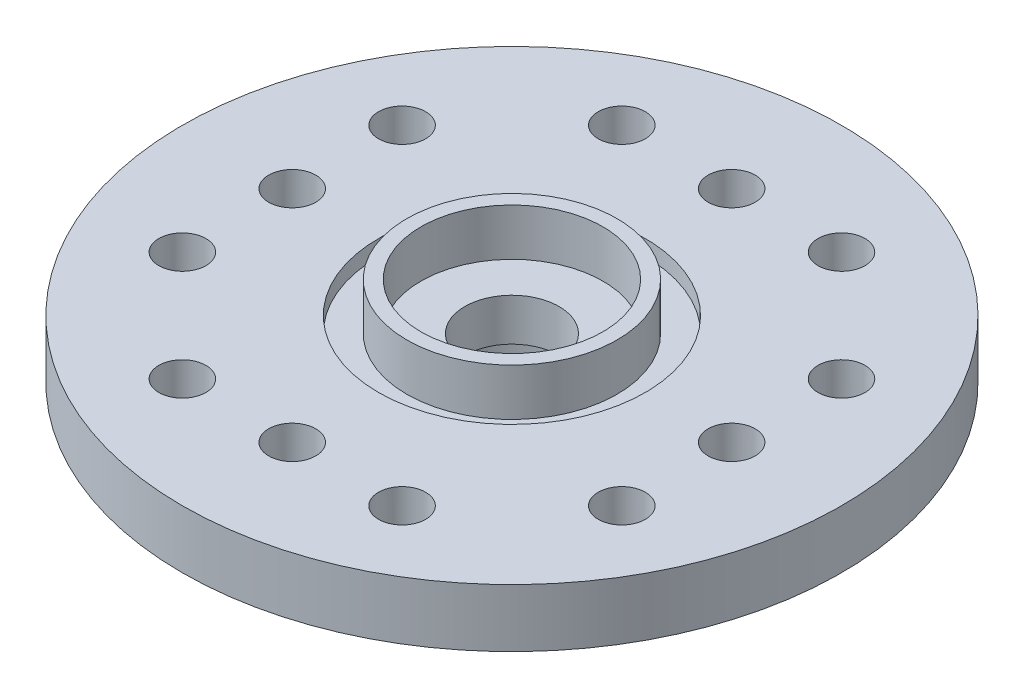
ISO-10303-21;
HEADER;
FILE_DESCRIPTION(('STEP AP214'),'2;1');
FILE_NAME('part.step','',(''),(''),'','','');
FILE_SCHEMA(('AUTOMOTIVE_DESIGN { 1 0 10303 214 1 1 1 1 }'));
ENDSEC;
DATA;
#1=APPLICATION_CONTEXT('core data for automotive mechanical design processes');
#2=APPLICATION_PROTOCOL_DEFINITION('international standard','automotive_design',2000,#1);
#3=PRODUCT_CONTEXT('',#1,'mechanical');
#4=PRODUCT('Part','Part','',(#3));
#5=PRODUCT_RELATED_PRODUCT_CATEGORY('part','',(#4));
#6=PRODUCT_DEFINITION_FORMATION('','',#4);
#7=PRODUCT_DEFINITION_CONTEXT('part definition',#1,'design');
#8=PRODUCT_DEFINITION('design','',#6,#7);
#9=PRODUCT_DEFINITION_SHAPE('','',#8);
#10=(LENGTH_UNIT() NAMED_UNIT(*) SI_UNIT(.MILLI.,.METRE.));
#11=(NAMED_UNIT(*) PLANE_ANGLE_UNIT() SI_UNIT($,.RADIAN.));
#12=(NAMED_UNIT(*) SI_UNIT($,.STERADIAN.) SOLID_ANGLE_UNIT());
#13=UNCERTAINTY_MEASURE_WITH_UNIT(LENGTH_MEASURE(1.E-05),#10,'distance_accuracy_value','');
#14=(GEOMETRIC_REPRESENTATION_CONTEXT(3) GLOBAL_UNCERTAINTY_ASSIGNED_CONTEXT((#13)) GLOBAL_UNIT_ASSIGNED_CONTEXT((#10,
#11,#12)) REPRESENTATION_CONTEXT('',''));
#15=CARTESIAN_POINT('',(0.,0.,0.));
#16=DIRECTION('',(0.,0.,1.));
#17=DIRECTION('',(1.,0.,0.));
#18=AXIS2_PLACEMENT_3D('',#15,#16,#17);
#19=CARTESIAN_POINT('',(0.,0.,0.));
#20=DIRECTION('',(0.,1.,0.));
#21=DIRECTION('',(0.,0.,1.));
#22=AXIS2_PLACEMENT_3D('',#19,#20,#21);
#23=PLANE('',#22);
#24=CARTESIAN_POINT('',(-6.99999999999996,0.,-3.50000000000007));
#25=DIRECTION('',(0.,1.,0.));
#26=DIRECTION('',(0.,0.,1.));
#27=AXIS2_PLACEMENT_3D('',#24,#25,#26);
#28=CIRCLE('',#27,0.75);
#29=CARTESIAN_POINT('',(-6.99999999999996,0.,-2.75000000000007));
#30=VERTEX_POINT('',#29);
#31=EDGE_CURVE('E144',#30,#30,#28,.T.);
#32=ORIENTED_EDGE('',*,*,#31,.T.);
#33=EDGE_LOOP('',(#32));
#34=FACE_BOUND('',#33,.T.);
#35=CARTESIAN_POINT('',(-7.,0.,0.));
#36=DIRECTION('',(0.,1.,0.));
#37=DIRECTION('',(0.,0.,1.));
#38=AXIS2_PLACEMENT_3D('',#35,#36,#37);
#39=CIRCLE('',#38,0.75);
#40=CARTESIAN_POINT('',(-7.,0.,0.749999999999927));
#41=VERTEX_POINT('',#40);
#42=EDGE_CURVE('E138',#41,#41,#39,.T.);
#43=ORIENTED_EDGE('',*,*,#42,.T.);
#44=EDGE_LOOP('',(#43));
#45=FACE_BOUND('',#44,.T.);
#46=CARTESIAN_POINT('',(-7.00000000000004,0.,3.49999999999993));
#47=DIRECTION('',(0.,1.,0.));
#48=DIRECTION('',(0.,0.,1.));
#49=AXIS2_PLACEMENT_3D('',#46,#47,#48);
#50=CIRCLE('',#49,0.75);
#51=CARTESIAN_POINT('',(-7.00000000000004,0.,4.24999999999993));
#52=VERTEX_POINT('',#51);
#53=EDGE_CURVE('E132',#52,#52,#50,.T.);
#54=ORIENTED_EDGE('',*,*,#53,.T.);
#55=EDGE_LOOP('',(#54));
#56=FACE_BOUND('',#55,.T.);
#57=CARTESIAN_POINT('',(-3.5,0.,7.));
#58=DIRECTION('',(0.,1.,0.));
#59=DIRECTION('',(0.,0.,1.));
#60=AXIS2_PLACEMENT_3D('',#57,#58,#59);
#61=CIRCLE('',#60,0.75);
#62=CARTESIAN_POINT('',(-3.5,0.,7.75));
#63=VERTEX_POINT('',#62);
#64=EDGE_CURVE('E126',#63,#63,#61,.T.);
#65=ORIENTED_EDGE('',*,*,#64,.T.);
#66=EDGE_LOOP('',(#65));
#67=FACE_BOUND('',#66,.T.);
#68=CARTESIAN_POINT('',(0.,0.,7.));
#69=DIRECTION('',(0.,1.,0.));
#70=DIRECTION('',(0.,0.,1.));
#71=AXIS2_PLACEMENT_3D('',#68,#69,#70);
#72=CIRCLE('',#71,0.75);
#73=CARTESIAN_POINT('',(0.,0.,7.75));
#74=VERTEX_POINT('',#73);
#75=EDGE_CURVE('E120',#74,#74,#72,.T.);
#76=ORIENTED_EDGE('',*,*,#75,.T.);
#77=EDGE_LOOP('',(#76));
#78=FACE_BOUND('',#77,.T.);
#79=CARTESIAN_POINT('',(3.5,0.,7.));
#80=DIRECTION('',(0.,1.,0.));
#81=DIRECTION('',(0.,0.,1.));
#82=AXIS2_PLACEMENT_3D('',#79,#80,#81);
#83=CIRCLE('',#82,0.75);
#84=CARTESIAN_POINT('',(3.5,0.,7.75));
#85=VERTEX_POINT('',#84);
#86=EDGE_CURVE('E114',#85,#85,#83,.T.);
#87=ORIENTED_EDGE('',*,*,#86,.T.);
#88=EDGE_LOOP('',(#87));
#89=FACE_BOUND('',#88,.T.);
#90=CARTESIAN_POINT('',(6.99999999999999,0.,3.50000000000002));
#91=DIRECTION('',(0.,1.,0.));
#92=DIRECTION('',(0.,0.,1.));
#93=AXIS2_PLACEMENT_3D('',#90,#91,#92);
#94=CIRCLE('',#93,0.75);
#95=CARTESIAN_POINT('',(6.99999999999999,0.,4.25000000000002));
#96=VERTEX_POINT('',#95);
#97=EDGE_CURVE('E108',#96,#96,#94,.T.);
#98=ORIENTED_EDGE('',*,*,#97,.T.);
#99=EDGE_LOOP('',(#98));
#100=FACE_BOUND('',#99,.T.);
#101=CARTESIAN_POINT('',(7.,0.,0.));
#102=DIRECTION('',(0.,1.,0.));
#103=DIRECTION('',(0.,0.,1.));
#104=AXIS2_PLACEMENT_3D('',#101,#102,#103);
#105=CIRCLE('',#104,0.75);
#106=CARTESIAN_POINT('',(7.,0.,0.750000000000025));
#107=VERTEX_POINT('',#106);
#108=EDGE_CURVE('E102',#107,#107,#105,.T.);
#109=ORIENTED_EDGE('',*,*,#108,.T.);
#110=EDGE_LOOP('',(#109));
#111=FACE_BOUND('',#110,.T.);
#112=CARTESIAN_POINT('',(7.00000000000001,0.,-3.49999999999998));
#113=DIRECTION('',(0.,1.,0.));
#114=DIRECTION('',(0.,0.,1.));
#115=AXIS2_PLACEMENT_3D('',#112,#113,#114);
#116=CIRCLE('',#115,0.75);
#117=CARTESIAN_POINT('',(7.00000000000001,0.,-2.74999999999998));
#118=VERTEX_POINT('',#117);
#119=EDGE_CURVE('E96',#118,#118,#116,.T.);
#120=ORIENTED_EDGE('',*,*,#119,.T.);
#121=EDGE_LOOP('',(#120));
#122=FACE_BOUND('',#121,.T.);
#123=CARTESIAN_POINT('',(3.5,0.,-7.));
#124=DIRECTION('',(0.,1.,0.));
#125=DIRECTION('',(0.,0.,1.));
#126=AXIS2_PLACEMENT_3D('',#123,#124,#125);
#127=CIRCLE('',#126,0.75);
#128=CARTESIAN_POINT('',(3.5,0.,-6.25));
#129=VERTEX_POINT('',#128);
#130=EDGE_CURVE('E90',#129,#129,#127,.T.);
#131=ORIENTED_EDGE('',*,*,#130,.T.);
#132=EDGE_LOOP('',(#131));
#133=FACE_BOUND('',#132,.T.);
#134=CARTESIAN_POINT('',(0.,0.,-7.));
#135=DIRECTION('',(0.,1.,0.));
#136=DIRECTION('',(0.,0.,1.));
#137=AXIS2_PLACEMENT_3D('',#134,#135,#136);
#138=CIRCLE('',#137,0.75);
#139=CARTESIAN_POINT('',(0.,0.,-6.25));
#140=VERTEX_POINT('',#139);
#141=EDGE_CURVE('E84',#140,#140,#138,.T.);
#142=ORIENTED_EDGE('',*,*,#141,.T.);
#143=EDGE_LOOP('',(#142));
#144=FACE_BOUND('',#143,.T.);
#145=CARTESIAN_POINT('',(-3.5,0.,-7.));
#146=DIRECTION('',(0.,1.,0.));
#147=DIRECTION('',(0.,0.,1.));
#148=AXIS2_PLACEMENT_3D('',#145,#146,#147);
#149=CIRCLE('',#148,0.75);
#150=CARTESIAN_POINT('',(-3.5,0.,-6.25));
#151=VERTEX_POINT('',#150);
#152=EDGE_CURVE('E78',#151,#151,#149,.T.);
#153=ORIENTED_EDGE('',*,*,#152,.T.);
#154=EDGE_LOOP('',(#153));
#155=FACE_BOUND('',#154,.T.);
#156=CARTESIAN_POINT('',(0.,0.,0.));
#157=DIRECTION('',(0.,1.,0.));
#158=DIRECTION('',(0.,0.,1.));
#159=AXIS2_PLACEMENT_3D('',#156,#157,#158);
#160=CIRCLE('',#159,10.5);
#161=CARTESIAN_POINT('',(0.,0.,10.5));
#162=VERTEX_POINT('',#161);
#163=EDGE_CURVE('E46',#162,#162,#160,.T.);
#164=ORIENTED_EDGE('',*,*,#163,.F.);
#165=EDGE_LOOP('',(#164));
#166=FACE_BOUND('',#165,.T.);
#167=CARTESIAN_POINT('',(0.,0.,0.));
#168=DIRECTION('',(0.,1.,0.));
#169=DIRECTION('',(0.,0.,1.));
#170=AXIS2_PLACEMENT_3D('',#167,#168,#169);
#171=CIRCLE('',#170,4.5);
#172=CARTESIAN_POINT('',(0.,0.,4.5));
#173=VERTEX_POINT('',#172);
#174=EDGE_CURVE('E10',#173,#173,#171,.F.);
#175=ORIENTED_EDGE('',*,*,#174,.F.);
#176=EDGE_LOOP('',(#175));
#177=FACE_BOUND('',#176,.T.);
#178=ADVANCED_FACE('F31',(#34,#45,#56,#67,#78,#89,#100,#111,#122,#133,#144,#155,#166,#177),#23,.F.);
#179=CARTESIAN_POINT('',(0.,1.35,0.));
#180=DIRECTION('',(0.,1.,0.));
#181=DIRECTION('',(0.,0.,1.));
#182=AXIS2_PLACEMENT_3D('',#179,#180,#181);
#183=PLANE('',#182);
#184=CARTESIAN_POINT('',(0.,1.35,0.));
#185=DIRECTION('',(0.,1.,0.));
#186=DIRECTION('',(0.,0.,1.));
#187=AXIS2_PLACEMENT_3D('',#184,#185,#186);
#188=CIRCLE('',#187,4.25);
#189=CARTESIAN_POINT('',(0.,1.35,4.25));
#190=VERTEX_POINT('',#189);
#191=EDGE_CURVE('E49',#190,#190,#188,.T.);
#192=ORIENTED_EDGE('',*,*,#191,.T.);
#193=EDGE_LOOP('',(#192));
#194=FACE_BOUND('',#193,.T.);
#195=CARTESIAN_POINT('',(0.,1.35,0.));
#196=DIRECTION('',(0.,1.,0.));
#197=DIRECTION('',(0.,0.,1.));
#198=AXIS2_PLACEMENT_3D('',#195,#196,#197);
#199=CIRCLE('',#198,3.35);
#200=CARTESIAN_POINT('',(0.,1.35,3.35));
#201=VERTEX_POINT('',#200);
#202=EDGE_CURVE('E58',#201,#201,#199,.T.);
#203=ORIENTED_EDGE('',*,*,#202,.F.);
#204=EDGE_LOOP('',(#203));
#205=FACE_BOUND('',#204,.T.);
#206=ADVANCED_FACE('F187',(#194,#205),#183,.T.);
#207=CARTESIAN_POINT('',(0.,1.85,0.));
#208=DIRECTION('',(0.,-1.,0.));
#209=DIRECTION('',(0.,0.,-1.));
#210=AXIS2_PLACEMENT_3D('',#207,#208,#209);
#211=CYLINDRICAL_SURFACE('',#210,10.5);
#212=CARTESIAN_POINT('',(0.,1.85,0.));
#213=DIRECTION('',(0.,1.,0.));
#214=DIRECTION('',(0.,0.,1.));
#215=AXIS2_PLACEMENT_3D('',#212,#213,#214);
#216=CIRCLE('',#215,10.5);
#217=CARTESIAN_POINT('',(0.,1.85,10.5));
#218=VERTEX_POINT('',#217);
#219=EDGE_CURVE('E43',#218,#218,#216,.T.);
#220=ORIENTED_EDGE('',*,*,#219,.F.);
#221=EDGE_LOOP('',(#220));
#222=FACE_BOUND('',#221,.T.);
#223=ORIENTED_EDGE('',*,*,#163,.T.);
#224=EDGE_LOOP('',(#223));
#225=FACE_BOUND('',#224,.T.);
#226=ADVANCED_FACE('F33',(#222,#225),#211,.T.);
#227=CARTESIAN_POINT('',(0.,1.85,0.));
#228=DIRECTION('',(0.,1.,0.));
#229=DIRECTION('',(0.,0.,1.));
#230=AXIS2_PLACEMENT_3D('',#227,#228,#229);
#231=PLANE('',#230);
#232=CARTESIAN_POINT('',(-6.99999999999996,1.85,-3.50000000000007));
#233=DIRECTION('',(0.,1.,0.));
#234=DIRECTION('',(1.,0.,0.));
#235=AXIS2_PLACEMENT_3D('',#232,#233,#234);
#236=CIRCLE('',#235,0.75);
#237=CARTESIAN_POINT('',(-6.24999999999996,1.85,-3.50000000000007));
#238=VERTEX_POINT('',#237);
#239=EDGE_CURVE('E147',#238,#238,#236,.T.);
#240=ORIENTED_EDGE('',*,*,#239,.F.);
#241=EDGE_LOOP('',(#240));
#242=FACE_BOUND('',#241,.T.);
#243=CARTESIAN_POINT('',(-7.,1.85,0.));
#244=DIRECTION('',(0.,1.,0.));
#245=DIRECTION('',(1.,0.,0.));
#246=AXIS2_PLACEMENT_3D('',#243,#244,#245);
#247=CIRCLE('',#246,0.75);
#248=CARTESIAN_POINT('',(-6.25,1.85,0.));
#249=VERTEX_POINT('',#248);
#250=EDGE_CURVE('E141',#249,#249,#247,.T.);
#251=ORIENTED_EDGE('',*,*,#250,.F.);
#252=EDGE_LOOP('',(#251));
#253=FACE_BOUND('',#252,.T.);
#254=CARTESIAN_POINT('',(-7.00000000000004,1.85,3.49999999999993));
#255=DIRECTION('',(0.,1.,0.));
#256=DIRECTION('',(1.,0.,0.));
#257=AXIS2_PLACEMENT_3D('',#254,#255,#256);
#258=CIRCLE('',#257,0.75);
#259=CARTESIAN_POINT('',(-6.25000000000004,1.85,3.49999999999993));
#260=VERTEX_POINT('',#259);
#261=EDGE_CURVE('E135',#260,#260,#258,.T.);
#262=ORIENTED_EDGE('',*,*,#261,.F.);
#263=EDGE_LOOP('',(#262));
#264=FACE_BOUND('',#263,.T.);
#265=CARTESIAN_POINT('',(-3.5,1.85,7.));
#266=DIRECTION('',(0.,1.,0.));
#267=DIRECTION('',(0.,0.,-1.));
#268=AXIS2_PLACEMENT_3D('',#265,#266,#267);
#269=CIRCLE('',#268,0.75);
#270=CARTESIAN_POINT('',(-3.5,1.85,6.25));
#271=VERTEX_POINT('',#270);
#272=EDGE_CURVE('E129',#271,#271,#269,.T.);
#273=ORIENTED_EDGE('',*,*,#272,.F.);
#274=EDGE_LOOP('',(#273));
#275=FACE_BOUND('',#274,.T.);
#276=CARTESIAN_POINT('',(0.,1.85,7.));
#277=DIRECTION('',(0.,1.,0.));
#278=DIRECTION('',(0.,0.,-1.));
#279=AXIS2_PLACEMENT_3D('',#276,#277,#278);
#280=CIRCLE('',#279,0.75);
#281=CARTESIAN_POINT('',(0.,1.85,6.25));
#282=VERTEX_POINT('',#281);
#283=EDGE_CURVE('E123',#282,#282,#280,.T.);
#284=ORIENTED_EDGE('',*,*,#283,.F.);
#285=EDGE_LOOP('',(#284));
#286=FACE_BOUND('',#285,.T.);
#287=CARTESIAN_POINT('',(3.5,1.85,7.));
#288=DIRECTION('',(0.,1.,0.));
#289=DIRECTION('',(0.,0.,-1.));
#290=AXIS2_PLACEMENT_3D('',#287,#288,#289);
#291=CIRCLE('',#290,0.75);
#292=CARTESIAN_POINT('',(3.5,1.85,6.25));
#293=VERTEX_POINT('',#292);
#294=EDGE_CURVE('E117',#293,#293,#291,.T.);
#295=ORIENTED_EDGE('',*,*,#294,.F.);
#296=EDGE_LOOP('',(#295));
#297=FACE_BOUND('',#296,.T.);
#298=CARTESIAN_POINT('',(6.99999999999999,1.85,3.50000000000002));
#299=DIRECTION('',(0.,1.,0.));
#300=DIRECTION('',(-1.,0.,0.));
#301=AXIS2_PLACEMENT_3D('',#298,#299,#300);
#302=CIRCLE('',#301,0.75);
#303=CARTESIAN_POINT('',(6.24999999999999,1.85,3.50000000000002));
#304=VERTEX_POINT('',#303);
#305=EDGE_CURVE('E111',#304,#304,#302,.T.);
#306=ORIENTED_EDGE('',*,*,#305,.F.);
#307=EDGE_LOOP('',(#306));
#308=FACE_BOUND('',#307,.T.);
#309=CARTESIAN_POINT('',(7.,1.85,0.));
#310=DIRECTION('',(0.,1.,0.));
#311=DIRECTION('',(-1.,0.,0.));
#312=AXIS2_PLACEMENT_3D('',#309,#310,#311);
#313=CIRCLE('',#312,0.75);
#314=CARTESIAN_POINT('',(6.25,1.85,0.));
#315=VERTEX_POINT('',#314);
#316=EDGE_CURVE('E105',#315,#315,#313,.T.);
#317=ORIENTED_EDGE('',*,*,#316,.F.);
#318=EDGE_LOOP('',(#317));
#319=FACE_BOUND('',#318,.T.);
#320=CARTESIAN_POINT('',(7.00000000000001,1.85,-3.49999999999998));
#321=DIRECTION('',(0.,1.,0.));
#322=DIRECTION('',(-1.,0.,0.));
#323=AXIS2_PLACEMENT_3D('',#320,#321,#322);
#324=CIRCLE('',#323,0.75);
#325=CARTESIAN_POINT('',(6.25000000000001,1.85,-3.49999999999998));
#326=VERTEX_POINT('',#325);
#327=EDGE_CURVE('E99',#326,#326,#324,.T.);
#328=ORIENTED_EDGE('',*,*,#327,.F.);
#329=EDGE_LOOP('',(#328));
#330=FACE_BOUND('',#329,.T.);
#331=CARTESIAN_POINT('',(3.5,1.85,-7.));
#332=DIRECTION('',(0.,1.,0.));
#333=DIRECTION('',(0.,0.,1.));
#334=AXIS2_PLACEMENT_3D('',#331,#332,#333);
#335=CIRCLE('',#334,0.75);
#336=CARTESIAN_POINT('',(3.5,1.85,-6.25));
#337=VERTEX_POINT('',#336);
#338=EDGE_CURVE('E93',#337,#337,#335,.T.);
#339=ORIENTED_EDGE('',*,*,#338,.F.);
#340=EDGE_LOOP('',(#339));
#341=FACE_BOUND('',#340,.T.);
#342=CARTESIAN_POINT('',(0.,1.85,-7.));
#343=DIRECTION('',(0.,1.,0.));
#344=DIRECTION('',(0.,0.,1.));
#345=AXIS2_PLACEMENT_3D('',#342,#343,#344);
#346=CIRCLE('',#345,0.75);
#347=CARTESIAN_POINT('',(0.,1.85,-6.25));
#348=VERTEX_POINT('',#347);
#349=EDGE_CURVE('E87',#348,#348,#346,.T.);
#350=ORIENTED_EDGE('',*,*,#349,.F.);
#351=EDGE_LOOP('',(#350));
#352=FACE_BOUND('',#351,.T.);
#353=CARTESIAN_POINT('',(-3.5,1.85,-7.));
#354=DIRECTION('',(0.,1.,0.));
#355=DIRECTION('',(0.,0.,1.));
#356=AXIS2_PLACEMENT_3D('',#353,#354,#355);
#357=CIRCLE('',#356,0.75);
#358=CARTESIAN_POINT('',(-3.5,1.85,-6.25));
#359=VERTEX_POINT('',#358);
#360=EDGE_CURVE('E81',#359,#359,#357,.T.);
#361=ORIENTED_EDGE('',*,*,#360,.F.);
#362=EDGE_LOOP('',(#361));
#363=FACE_BOUND('',#362,.T.);
#364=CARTESIAN_POINT('',(0.,1.85,0.));
#365=DIRECTION('',(0.,1.,0.));
#366=DIRECTION('',(0.,0.,1.));
#367=AXIS2_PLACEMENT_3D('',#364,#365,#366);
#368=CIRCLE('',#367,4.25);
#369=CARTESIAN_POINT('',(0.,1.85,4.25));
#370=VERTEX_POINT('',#369);
#371=EDGE_CURVE('E52',#370,#370,#368,.T.);
#372=ORIENTED_EDGE('',*,*,#371,.F.);
#373=EDGE_LOOP('',(#372));
#374=FACE_BOUND('',#373,.T.);
#375=ORIENTED_EDGE('',*,*,#219,.T.);
#376=EDGE_LOOP('',(#375));
#377=FACE_BOUND('',#376,.T.);
#378=ADVANCED_FACE('F154',(#242,#253,#264,#275,#286,#297,#308,#319,#330,#341,#352,#363,#374,
#377),#231,.T.);
#379=CARTESIAN_POINT('',(0.,1.35,0.));
#380=DIRECTION('',(0.,1.,0.));
#381=DIRECTION('',(0.,0.,1.));
#382=AXIS2_PLACEMENT_3D('',#379,#380,#381);
#383=CYLINDRICAL_SURFACE('',#382,4.25);
#384=ORIENTED_EDGE('',*,*,#191,.F.);
#385=EDGE_LOOP('',(#384));
#386=FACE_BOUND('',#385,.T.);
#387=ORIENTED_EDGE('',*,*,#371,.T.);
#388=EDGE_LOOP('',(#387));
#389=FACE_BOUND('',#388,.T.);
#390=ADVANCED_FACE('F157',(#386,#389),#383,.F.);
#391=CARTESIAN_POINT('',(0.,2.85,0.));
#392=DIRECTION('',(0.,1.,0.));
#393=DIRECTION('',(0.,0.,1.));
#394=AXIS2_PLACEMENT_3D('',#391,#392,#393);
#395=PLANE('',#394);
#396=CARTESIAN_POINT('',(0.,2.85,0.));
#397=DIRECTION('',(0.,1.,0.));
#398=DIRECTION('',(0.,0.,1.));
#399=AXIS2_PLACEMENT_3D('',#396,#397,#398);
#400=CIRCLE('',#399,3.35);
#401=CARTESIAN_POINT('',(0.,2.85,3.35));
#402=VERTEX_POINT('',#401);
#403=EDGE_CURVE('E55',#402,#402,#400,.T.);
#404=ORIENTED_EDGE('',*,*,#403,.T.);
#405=EDGE_LOOP('',(#404));
#406=FACE_BOUND('',#405,.T.);
#407=CARTESIAN_POINT('',(0.,2.85,0.));
#408=DIRECTION('',(0.,1.,0.));
#409=DIRECTION('',(0.,0.,1.));
#410=AXIS2_PLACEMENT_3D('',#407,#408,#409);
#411=CIRCLE('',#410,2.9);
#412=CARTESIAN_POINT('',(0.,2.85,2.9));
#413=VERTEX_POINT('',#412);
#414=EDGE_CURVE('E61',#413,#413,#411,.T.);
#415=ORIENTED_EDGE('',*,*,#414,.F.);
#416=EDGE_LOOP('',(#415));
#417=FACE_BOUND('',#416,.T.);
#418=ADVANCED_FACE('F237',(#406,#417),#395,.T.);
#419=CARTESIAN_POINT('',(0.,2.85,0.));
#420=DIRECTION('',(0.,-1.,0.));
#421=DIRECTION('',(0.,0.,-1.));
#422=AXIS2_PLACEMENT_3D('',#419,#420,#421);
#423=CYLINDRICAL_SURFACE('',#422,3.35);
#424=ORIENTED_EDGE('',*,*,#403,.F.);
#425=EDGE_LOOP('',(#424));
#426=FACE_BOUND('',#425,.T.);
#427=ORIENTED_EDGE('',*,*,#202,.T.);
#428=EDGE_LOOP('',(#427));
#429=FACE_BOUND('',#428,.T.);
#430=ADVANCED_FACE('F235',(#426,#429),#423,.T.);
#431=CARTESIAN_POINT('',(0.,2.85,0.));
#432=DIRECTION('',(0.,-1.,0.));
#433=DIRECTION('',(0.,0.,-1.));
#434=AXIS2_PLACEMENT_3D('',#431,#432,#433);
#435=CYLINDRICAL_SURFACE('',#434,2.9);
#436=ORIENTED_EDGE('',*,*,#414,.T.);
#437=EDGE_LOOP('',(#436));
#438=FACE_BOUND('',#437,.T.);
#439=CARTESIAN_POINT('',(0.,1.35,0.));
#440=DIRECTION('',(0.,1.,0.));
#441=DIRECTION('',(0.,0.,1.));
#442=AXIS2_PLACEMENT_3D('',#439,#440,#441);
#443=CIRCLE('',#442,2.9);
#444=CARTESIAN_POINT('',(0.,1.35,2.9));
#445=VERTEX_POINT('',#444);
#446=EDGE_CURVE('E39',#445,#445,#443,.F.);
#447=ORIENTED_EDGE('',*,*,#446,.T.);
#448=EDGE_LOOP('',(#447));
#449=FACE_BOUND('',#448,.T.);
#450=ADVANCED_FACE('F232',(#438,#449),#435,.F.);
#451=CARTESIAN_POINT('',(0.,1.35,0.));
#452=DIRECTION('',(0.,1.,0.));
#453=DIRECTION('',(0.,0.,1.));
#454=AXIS2_PLACEMENT_3D('',#451,#452,#453);
#455=CIRCLE('',#454,1.5);
#456=CARTESIAN_POINT('',(0.,1.35,1.5));
#457=VERTEX_POINT('',#456);
#458=EDGE_CURVE('E75',#457,#457,#455,.T.);
#459=ORIENTED_EDGE('',*,*,#458,.F.);
#460=EDGE_LOOP('',(#459));
#461=FACE_BOUND('',#460,.T.);
#462=ORIENTED_EDGE('',*,*,#446,.F.);
#463=EDGE_LOOP('',(#462));
#464=FACE_BOUND('',#463,.T.);
#465=ADVANCED_FACE('F199',(#461,#464),#183,.T.);
#466=CARTESIAN_POINT('',(0.,-3.5,0.));
#467=DIRECTION('',(0.,-1.,0.));
#468=DIRECTION('',(0.,0.,-1.));
#469=AXIS2_PLACEMENT_3D('',#466,#467,#468);
#470=PLANE('',#469);
#471=CARTESIAN_POINT('',(0.,-3.5,0.));
#472=DIRECTION('',(0.,-1.,0.));
#473=DIRECTION('',(0.,0.,-1.));
#474=AXIS2_PLACEMENT_3D('',#471,#472,#473);
#475=CIRCLE('',#474,4.5);
#476=CARTESIAN_POINT('',(0.,-3.5,-4.5));
#477=VERTEX_POINT('',#476);
#478=EDGE_CURVE('E66',#477,#477,#475,.T.);
#479=ORIENTED_EDGE('',*,*,#478,.T.);
#480=EDGE_LOOP('',(#479));
#481=FACE_BOUND('',#480,.T.);
#482=CARTESIAN_POINT('',(0.,-3.5,0.));
#483=DIRECTION('',(0.,-1.,0.));
#484=DIRECTION('',(0.,0.,-1.));
#485=AXIS2_PLACEMENT_3D('',#482,#483,#484);
#486=CIRCLE('',#485,2.75);
#487=CARTESIAN_POINT('',(0.,-3.5,-2.75));
#488=VERTEX_POINT('',#487);
#489=EDGE_CURVE('E69',#488,#488,#486,.T.);
#490=ORIENTED_EDGE('',*,*,#489,.F.);
#491=EDGE_LOOP('',(#490));
#492=FACE_BOUND('',#491,.T.);
#493=ADVANCED_FACE('F224',(#481,#492),#470,.T.);
#494=CARTESIAN_POINT('',(0.,-3.5,0.));
#495=DIRECTION('',(0.,1.,0.));
#496=DIRECTION('',(0.,0.,1.));
#497=AXIS2_PLACEMENT_3D('',#494,#495,#496);
#498=CYLINDRICAL_SURFACE('',#497,4.5);
#499=ORIENTED_EDGE('',*,*,#478,.F.);
#500=EDGE_LOOP('',(#499));
#501=FACE_BOUND('',#500,.T.);
#502=ORIENTED_EDGE('',*,*,#174,.T.);
#503=EDGE_LOOP('',(#502));
#504=FACE_BOUND('',#503,.T.);
#505=ADVANCED_FACE('F212',(#501,#504),#498,.T.);
#506=CARTESIAN_POINT('',(0.,-3.5,0.));
#507=DIRECTION('',(0.,1.,0.));
#508=DIRECTION('',(0.,0.,1.));
#509=AXIS2_PLACEMENT_3D('',#506,#507,#508);
#510=CYLINDRICAL_SURFACE('',#509,2.75);
#511=ORIENTED_EDGE('',*,*,#489,.T.);
#512=EDGE_LOOP('',(#511));
#513=FACE_BOUND('',#512,.T.);
#514=CARTESIAN_POINT('',(0.,0.,0.));
#515=DIRECTION('',(0.,-1.,0.));
#516=DIRECTION('',(0.,0.,-1.));
#517=AXIS2_PLACEMENT_3D('',#514,#515,#516);
#518=CIRCLE('',#517,2.75);
#519=CARTESIAN_POINT('',(0.,0.,-2.75));
#520=VERTEX_POINT('',#519);
#521=EDGE_CURVE('E70',#520,#520,#518,.T.);
#522=ORIENTED_EDGE('',*,*,#521,.F.);
#523=EDGE_LOOP('',(#522));
#524=FACE_BOUND('',#523,.T.);
#525=ADVANCED_FACE('F203',(#513,#524),#510,.F.);
#526=CARTESIAN_POINT('',(0.,0.,0.));
#527=DIRECTION('',(0.,1.,0.));
#528=DIRECTION('',(0.,0.,1.));
#529=AXIS2_PLACEMENT_3D('',#526,#527,#528);
#530=CIRCLE('',#529,1.5);
#531=CARTESIAN_POINT('',(0.,0.,1.5));
#532=VERTEX_POINT('',#531);
#533=EDGE_CURVE('E35',#532,#532,#530,.T.);
#534=ORIENTED_EDGE('',*,*,#533,.T.);
#535=EDGE_LOOP('',(#534));
#536=FACE_BOUND('',#535,.T.);
#537=ORIENTED_EDGE('',*,*,#521,.T.);
#538=EDGE_LOOP('',(#537));
#539=FACE_BOUND('',#538,.T.);
#540=ADVANCED_FACE('F193',(#536,#539),#23,.F.);
#541=CARTESIAN_POINT('',(0.,-3.5,0.));
#542=DIRECTION('',(0.,1.,0.));
#543=DIRECTION('',(0.,0.,1.));
#544=AXIS2_PLACEMENT_3D('',#541,#542,#543);
#545=CYLINDRICAL_SURFACE('',#544,1.5);
#546=ORIENTED_EDGE('',*,*,#458,.T.);
#547=EDGE_LOOP('',(#546));
#548=FACE_BOUND('',#547,.T.);
#549=ORIENTED_EDGE('',*,*,#533,.F.);
#550=EDGE_LOOP('',(#549));
#551=FACE_BOUND('',#550,.T.);
#552=ADVANCED_FACE('F202',(#548,#551),#545,.F.);
#553=CARTESIAN_POINT('',(-3.5,-3.5,-7.));
#554=DIRECTION('',(0.,1.,0.));
#555=DIRECTION('',(0.,0.,1.));
#556=AXIS2_PLACEMENT_3D('',#553,#554,#555);
#557=CYLINDRICAL_SURFACE('',#556,0.75);
#558=ORIENTED_EDGE('',*,*,#360,.T.);
#559=EDGE_LOOP('',(#558));
#560=FACE_BOUND('',#559,.T.);
#561=ORIENTED_EDGE('',*,*,#152,.F.);
#562=EDGE_LOOP('',(#561));
#563=FACE_BOUND('',#562,.T.);
#564=ADVANCED_FACE('F209',(#560,#563),#557,.F.);
#565=CARTESIAN_POINT('',(0.,-3.5,-7.));
#566=DIRECTION('',(0.,1.,0.));
#567=DIRECTION('',(0.,0.,1.));
#568=AXIS2_PLACEMENT_3D('',#565,#566,#567);
#569=CYLINDRICAL_SURFACE('',#568,0.75);
#570=ORIENTED_EDGE('',*,*,#349,.T.);
#571=EDGE_LOOP('',(#570));
#572=FACE_BOUND('',#571,.T.);
#573=ORIENTED_EDGE('',*,*,#141,.F.);
#574=EDGE_LOOP('',(#573));
#575=FACE_BOUND('',#574,.T.);
#576=ADVANCED_FACE('F302',(#572,#575),#569,.F.);
#577=CARTESIAN_POINT('',(3.5,-3.5,-7.));
#578=DIRECTION('',(0.,1.,0.));
#579=DIRECTION('',(0.,0.,1.));
#580=AXIS2_PLACEMENT_3D('',#577,#578,#579);
#581=CYLINDRICAL_SURFACE('',#580,0.75);
#582=ORIENTED_EDGE('',*,*,#338,.T.);
#583=EDGE_LOOP('',(#582));
#584=FACE_BOUND('',#583,.T.);
#585=ORIENTED_EDGE('',*,*,#130,.F.);
#586=EDGE_LOOP('',(#585));
#587=FACE_BOUND('',#586,.T.);
#588=ADVANCED_FACE('F310',(#584,#587),#581,.F.);
#589=CARTESIAN_POINT('',(7.00000000000001,-3.5,-3.49999999999998));
#590=DIRECTION('',(0.,1.,0.));
#591=DIRECTION('',(0.,0.,1.));
#592=AXIS2_PLACEMENT_3D('',#589,#590,#591);
#593=CYLINDRICAL_SURFACE('',#592,0.75);
#594=ORIENTED_EDGE('',*,*,#327,.T.);
#595=EDGE_LOOP('',(#594));
#596=FACE_BOUND('',#595,.T.);
#597=ORIENTED_EDGE('',*,*,#119,.F.);
#598=EDGE_LOOP('',(#597));
#599=FACE_BOUND('',#598,.T.);
#600=ADVANCED_FACE('F319',(#596,#599),#593,.F.);
#601=CARTESIAN_POINT('',(7.,-3.5,0.));
#602=DIRECTION('',(0.,1.,0.));
#603=DIRECTION('',(0.,0.,1.));
#604=AXIS2_PLACEMENT_3D('',#601,#602,#603);
#605=CYLINDRICAL_SURFACE('',#604,0.75);
#606=ORIENTED_EDGE('',*,*,#316,.T.);
#607=EDGE_LOOP('',(#606));
#608=FACE_BOUND('',#607,.T.);
#609=ORIENTED_EDGE('',*,*,#108,.F.);
#610=EDGE_LOOP('',(#609));
#611=FACE_BOUND('',#610,.T.);
#612=ADVANCED_FACE('F328',(#608,#611),#605,.F.);
#613=CARTESIAN_POINT('',(6.99999999999999,-3.5,3.50000000000002));
#614=DIRECTION('',(0.,1.,0.));
#615=DIRECTION('',(0.,0.,1.));
#616=AXIS2_PLACEMENT_3D('',#613,#614,#615);
#617=CYLINDRICAL_SURFACE('',#616,0.75);
#618=ORIENTED_EDGE('',*,*,#305,.T.);
#619=EDGE_LOOP('',(#618));
#620=FACE_BOUND('',#619,.T.);
#621=ORIENTED_EDGE('',*,*,#97,.F.);
#622=EDGE_LOOP('',(#621));
#623=FACE_BOUND('',#622,.T.);
#624=ADVANCED_FACE('F337',(#620,#623),#617,.F.);
#625=CARTESIAN_POINT('',(3.5,-3.5,7.));
#626=DIRECTION('',(0.,1.,0.));
#627=DIRECTION('',(0.,0.,1.));
#628=AXIS2_PLACEMENT_3D('',#625,#626,#627);
#629=CYLINDRICAL_SURFACE('',#628,0.75);
#630=ORIENTED_EDGE('',*,*,#294,.T.);
#631=EDGE_LOOP('',(#630));
#632=FACE_BOUND('',#631,.T.);
#633=ORIENTED_EDGE('',*,*,#86,.F.);
#634=EDGE_LOOP('',(#633));
#635=FACE_BOUND('',#634,.T.);
#636=ADVANCED_FACE('F346',(#632,#635),#629,.F.);
#637=CARTESIAN_POINT('',(0.,-3.5,7.));
#638=DIRECTION('',(0.,1.,0.));
#639=DIRECTION('',(0.,0.,1.));
#640=AXIS2_PLACEMENT_3D('',#637,#638,#639);
#641=CYLINDRICAL_SURFACE('',#640,0.75);
#642=ORIENTED_EDGE('',*,*,#283,.T.);
#643=EDGE_LOOP('',(#642));
#644=FACE_BOUND('',#643,.T.);
#645=ORIENTED_EDGE('',*,*,#75,.F.);
#646=EDGE_LOOP('',(#645));
#647=FACE_BOUND('',#646,.T.);
#648=ADVANCED_FACE('F355',(#644,#647),#641,.F.);
#649=CARTESIAN_POINT('',(-3.5,-3.5,7.));
#650=DIRECTION('',(0.,1.,0.));
#651=DIRECTION('',(0.,0.,1.));
#652=AXIS2_PLACEMENT_3D('',#649,#650,#651);
#653=CYLINDRICAL_SURFACE('',#652,0.75);
#654=ORIENTED_EDGE('',*,*,#272,.T.);
#655=EDGE_LOOP('',(#654));
#656=FACE_BOUND('',#655,.T.);
#657=ORIENTED_EDGE('',*,*,#64,.F.);
#658=EDGE_LOOP('',(#657));
#659=FACE_BOUND('',#658,.T.);
#660=ADVANCED_FACE('F364',(#656,#659),#653,.F.);
#661=CARTESIAN_POINT('',(-7.00000000000004,-3.5,3.49999999999993));
#662=DIRECTION('',(0.,1.,0.));
#663=DIRECTION('',(0.,0.,1.));
#664=AXIS2_PLACEMENT_3D('',#661,#662,#663);
#665=CYLINDRICAL_SURFACE('',#664,0.75);
#666=ORIENTED_EDGE('',*,*,#261,.T.);
#667=EDGE_LOOP('',(#666));
#668=FACE_BOUND('',#667,.T.);
#669=ORIENTED_EDGE('',*,*,#53,.F.);
#670=EDGE_LOOP('',(#669));
#671=FACE_BOUND('',#670,.T.);
#672=ADVANCED_FACE('F373',(#668,#671),#665,.F.);
#673=CARTESIAN_POINT('',(-7.,-3.5,0.));
#674=DIRECTION('',(0.,1.,0.));
#675=DIRECTION('',(0.,0.,1.));
#676=AXIS2_PLACEMENT_3D('',#673,#674,#675);
#677=CYLINDRICAL_SURFACE('',#676,0.75);
#678=ORIENTED_EDGE('',*,*,#250,.T.);
#679=EDGE_LOOP('',(#678));
#680=FACE_BOUND('',#679,.T.);
#681=ORIENTED_EDGE('',*,*,#42,.F.);
#682=EDGE_LOOP('',(#681));
#683=FACE_BOUND('',#682,.T.);
#684=ADVANCED_FACE('F382',(#680,#683),#677,.F.);
#685=CARTESIAN_POINT('',(-6.99999999999996,-3.5,-3.50000000000007));
#686=DIRECTION('',(0.,1.,0.));
#687=DIRECTION('',(0.,0.,1.));
#688=AXIS2_PLACEMENT_3D('',#685,#686,#687);
#689=CYLINDRICAL_SURFACE('',#688,0.75);
#690=ORIENTED_EDGE('',*,*,#239,.T.);
#691=EDGE_LOOP('',(#690));
#692=FACE_BOUND('',#691,.T.);
#693=ORIENTED_EDGE('',*,*,#31,.F.);
#694=EDGE_LOOP('',(#693));
#695=FACE_BOUND('',#694,.T.);
#696=ADVANCED_FACE('F151',(#692,#695),#689,.F.);
#697=CLOSED_SHELL('',(#178,#206,#226,#378,#390,#418,#430,#450,#465,#493,#505,#525,#540,#552,
#564,#576,#588,#600,#612,#624,#636,#648,#660,#672,#684,#696));
#698=MANIFOLD_SOLID_BREP('B2',#697);
#699=ADVANCED_BREP_SHAPE_REPRESENTATION('',(#18,#698),#14);
#700=SHAPE_DEFINITION_REPRESENTATION(#9,#699);
ENDSEC;
END-ISO-10303-21;
